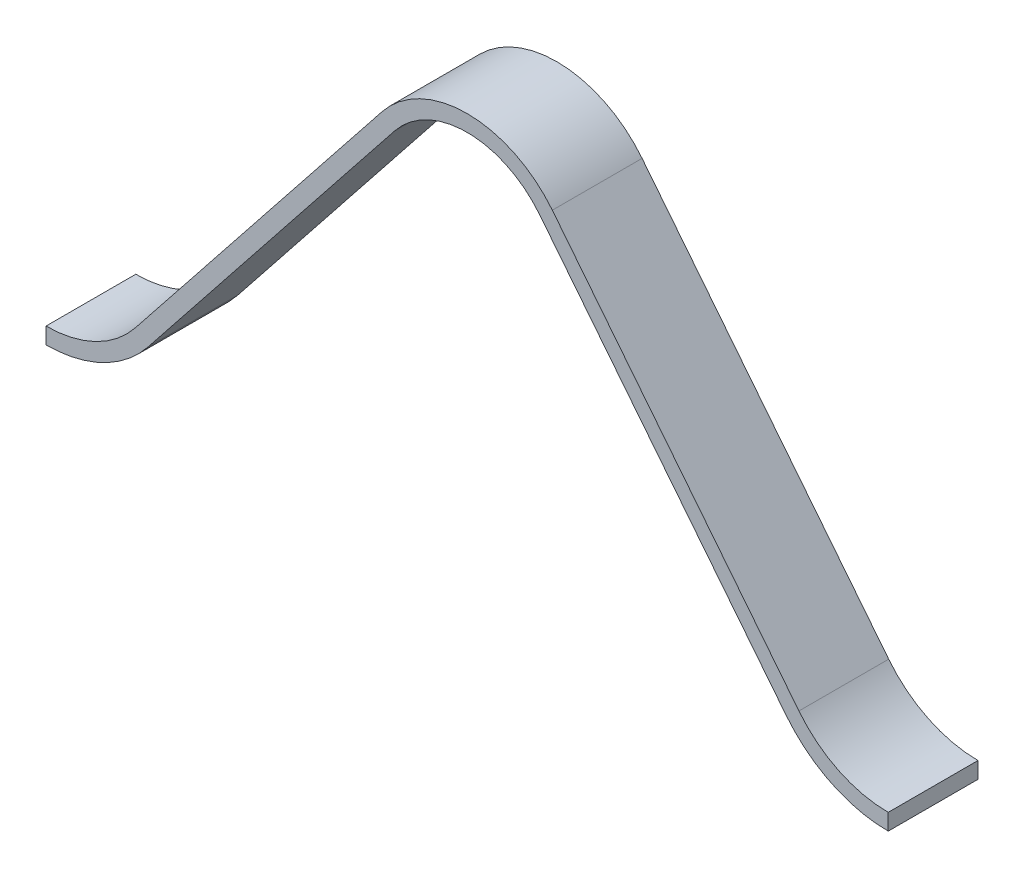
ISO-10303-21;
HEADER;
FILE_DESCRIPTION(('STEP AP214'),'2;1');
FILE_NAME('part.step','',(''),(''),'','','');
FILE_SCHEMA(('AUTOMOTIVE_DESIGN { 1 0 10303 214 1 1 1 1 }'));
ENDSEC;
DATA;
#1=APPLICATION_CONTEXT('core data for automotive mechanical design processes');
#2=APPLICATION_PROTOCOL_DEFINITION('international standard','automotive_design',2000,#1);
#3=PRODUCT_CONTEXT('',#1,'mechanical');
#4=PRODUCT('Part','Part','',(#3));
#5=PRODUCT_RELATED_PRODUCT_CATEGORY('part','',(#4));
#6=PRODUCT_DEFINITION_FORMATION('','',#4);
#7=PRODUCT_DEFINITION_CONTEXT('part definition',#1,'design');
#8=PRODUCT_DEFINITION('design','',#6,#7);
#9=PRODUCT_DEFINITION_SHAPE('','',#8);
#10=(LENGTH_UNIT() NAMED_UNIT(*) SI_UNIT(.MILLI.,.METRE.));
#11=(NAMED_UNIT(*) PLANE_ANGLE_UNIT() SI_UNIT($,.RADIAN.));
#12=(NAMED_UNIT(*) SI_UNIT($,.STERADIAN.) SOLID_ANGLE_UNIT());
#13=UNCERTAINTY_MEASURE_WITH_UNIT(LENGTH_MEASURE(1.E-05),#10,'distance_accuracy_value','');
#14=(GEOMETRIC_REPRESENTATION_CONTEXT(3) GLOBAL_UNCERTAINTY_ASSIGNED_CONTEXT((#13)) GLOBAL_UNIT_ASSIGNED_CONTEXT((#10,
#11,#12)) REPRESENTATION_CONTEXT('',''));
#15=CARTESIAN_POINT('',(0.,0.,0.));
#16=DIRECTION('',(0.,0.,1.));
#17=DIRECTION('',(1.,0.,0.));
#18=AXIS2_PLACEMENT_3D('',#15,#16,#17);
#19=CARTESIAN_POINT('',(-28.15,-11.48,0.));
#20=DIRECTION('',(0.,0.,-1.));
#21=DIRECTION('',(0.,-1.,0.));
#22=AXIS2_PLACEMENT_3D('',#19,#20,#21);
#23=PLANE('',#22);
#24=CARTESIAN_POINT('',(-28.15,-11.48,0.));
#25=DIRECTION('',(0.,0.,-1.));
#26=DIRECTION('',(-1.,0.,0.));
#27=AXIS2_PLACEMENT_3D('',#24,#25,#26);
#28=CIRCLE('',#27,7.625);
#29=CARTESIAN_POINT('',(-22.1797397026617,-16.2230598754418,0.));
#30=VERTEX_POINT('',#29);
#31=CARTESIAN_POINT('',(-28.15,-19.105,0.));
#32=VERTEX_POINT('',#31);
#33=EDGE_CURVE('E351',#30,#32,#28,.T.);
#34=ORIENTED_EDGE('',*,*,#33,.F.);
#35=DIRECTION('',(-0.622040639402208,-0.78298495702797,0.));
#36=VECTOR('',#35,1.);
#37=CARTESIAN_POINT('',(-22.1797397026617,-16.2230598754418,0.));
#38=LINE('',#37,#36);
#39=CARTESIAN_POINT('',(-5.69621556237848,4.52534565165107,0.));
#40=VERTEX_POINT('',#39);
#41=EDGE_CURVE('E26',#40,#30,#38,.T.);
#42=ORIENTED_EDGE('',*,*,#41,.F.);
#43=CARTESIAN_POINT('',(0.,0.,0.));
#44=DIRECTION('',(0.,0.,1.));
#45=DIRECTION('',(-1.,0.,0.));
#46=AXIS2_PLACEMENT_3D('',#43,#44,#45);
#47=CIRCLE('',#46,7.275);
#48=CARTESIAN_POINT('',(5.69621556237848,4.52534565165106,0.));
#49=VERTEX_POINT('',#48);
#50=EDGE_CURVE('E192',#49,#40,#47,.T.);
#51=ORIENTED_EDGE('',*,*,#50,.F.);
#52=DIRECTION('',(-0.622040639402208,0.78298495702797,0.));
#53=VECTOR('',#52,1.);
#54=CARTESIAN_POINT('',(5.69621556237848,4.52534565165107,0.));
#55=LINE('',#54,#53);
#56=CARTESIAN_POINT('',(22.1797397026617,-16.2230598754418,0.));
#57=VERTEX_POINT('',#56);
#58=EDGE_CURVE('E183',#57,#49,#55,.T.);
#59=ORIENTED_EDGE('',*,*,#58,.F.);
#60=CARTESIAN_POINT('',(28.15,-11.48,0.));
#61=DIRECTION('',(0.,0.,-1.));
#62=DIRECTION('',(1.,0.,0.));
#63=AXIS2_PLACEMENT_3D('',#60,#61,#62);
#64=CIRCLE('',#63,7.625);
#65=CARTESIAN_POINT('',(28.15,-19.105,0.));
#66=VERTEX_POINT('',#65);
#67=EDGE_CURVE('E144',#66,#57,#64,.T.);
#68=ORIENTED_EDGE('',*,*,#67,.F.);
#69=DIRECTION('',(0.,1.,0.));
#70=VECTOR('',#69,1.);
#71=CARTESIAN_POINT('',(28.15,-19.105,0.));
#72=LINE('',#71,#70);
#73=CARTESIAN_POINT('',(28.15,-20.195,0.));
#74=VERTEX_POINT('',#73);
#75=EDGE_CURVE('E156',#74,#66,#72,.T.);
#76=ORIENTED_EDGE('',*,*,#75,.F.);
#77=CARTESIAN_POINT('',(28.15,-11.48,0.));
#78=DIRECTION('',(0.,0.,1.));
#79=DIRECTION('',(1.,0.,0.));
#80=AXIS2_PLACEMENT_3D('',#77,#78,#79);
#81=CIRCLE('',#80,8.715);
#82=CARTESIAN_POINT('',(21.3262860995012,-16.9010841723903,0.));
#83=VERTEX_POINT('',#82);
#84=EDGE_CURVE('E159',#83,#74,#81,.T.);
#85=ORIENTED_EDGE('',*,*,#84,.F.);
#86=DIRECTION('',(0.622040639402208,-0.78298495702797,0.));
#87=VECTOR('',#86,1.);
#88=CARTESIAN_POINT('',(4.84276195921799,3.84732135470265,0.));
#89=LINE('',#88,#87);
#90=CARTESIAN_POINT('',(4.84276195921799,3.84732135470265,0.));
#91=VERTEX_POINT('',#90);
#92=EDGE_CURVE('E233',#91,#83,#89,.T.);
#93=ORIENTED_EDGE('',*,*,#92,.F.);
#94=CARTESIAN_POINT('',(0.,0.,0.));
#95=DIRECTION('',(0.,0.,-1.));
#96=DIRECTION('',(-1.,0.,0.));
#97=AXIS2_PLACEMENT_3D('',#94,#95,#96);
#98=CIRCLE('',#97,6.185);
#99=CARTESIAN_POINT('',(-4.84276195921799,3.84732135470266,0.));
#100=VERTEX_POINT('',#99);
#101=EDGE_CURVE('E217',#100,#91,#98,.T.);
#102=ORIENTED_EDGE('',*,*,#101,.F.);
#103=DIRECTION('',(0.622040639402208,0.78298495702797,0.));
#104=VECTOR('',#103,1.);
#105=CARTESIAN_POINT('',(-21.3262860995012,-16.9010841723903,0.));
#106=LINE('',#105,#104);
#107=CARTESIAN_POINT('',(-21.3262860995012,-16.9010841723903,0.));
#108=VERTEX_POINT('',#107);
#109=EDGE_CURVE('E216',#108,#100,#106,.T.);
#110=ORIENTED_EDGE('',*,*,#109,.F.);
#111=CARTESIAN_POINT('',(-28.15,-11.48,0.));
#112=DIRECTION('',(0.,0.,1.));
#113=DIRECTION('',(-1.,0.,0.));
#114=AXIS2_PLACEMENT_3D('',#111,#112,#113);
#115=CIRCLE('',#114,8.715);
#116=CARTESIAN_POINT('',(-28.15,-20.195,0.));
#117=VERTEX_POINT('',#116);
#118=EDGE_CURVE('E301',#117,#108,#115,.T.);
#119=ORIENTED_EDGE('',*,*,#118,.F.);
#120=DIRECTION('',(0.,-1.,0.));
#121=VECTOR('',#120,1.);
#122=CARTESIAN_POINT('',(-28.15,-19.105,0.));
#123=LINE('',#122,#121);
#124=EDGE_CURVE('E324',#32,#117,#123,.T.);
#125=ORIENTED_EDGE('',*,*,#124,.F.);
#126=EDGE_LOOP('',(#34,#42,#51,#59,#68,#76,#85,#93,#102,#110,#119,#125));
#127=FACE_BOUND('',#126,.T.);
#128=ADVANCED_FACE('F17',(#127),#23,.T.);
#129=CARTESIAN_POINT('',(-28.15,-11.48,6.));
#130=DIRECTION('',(0.,0.,-1.));
#131=DIRECTION('',(0.,-1.,0.));
#132=AXIS2_PLACEMENT_3D('',#129,#130,#131);
#133=PLANE('',#132);
#134=CARTESIAN_POINT('',(-28.15,-11.48,6.));
#135=DIRECTION('',(0.,0.,-1.));
#136=DIRECTION('',(-1.,0.,0.));
#137=AXIS2_PLACEMENT_3D('',#134,#135,#136);
#138=CIRCLE('',#137,7.625);
#139=CARTESIAN_POINT('',(-22.1797397026617,-16.2230598754418,6.));
#140=VERTEX_POINT('',#139);
#141=CARTESIAN_POINT('',(-28.15,-19.105,6.));
#142=VERTEX_POINT('',#141);
#143=EDGE_CURVE('E336',#140,#142,#138,.T.);
#144=ORIENTED_EDGE('',*,*,#143,.T.);
#145=DIRECTION('',(0.,-1.,0.));
#146=VECTOR('',#145,1.);
#147=CARTESIAN_POINT('',(-28.15,-19.105,6.));
#148=LINE('',#147,#146);
#149=CARTESIAN_POINT('',(-28.15,-20.195,6.));
#150=VERTEX_POINT('',#149);
#151=EDGE_CURVE('E308',#142,#150,#148,.T.);
#152=ORIENTED_EDGE('',*,*,#151,.T.);
#153=CARTESIAN_POINT('',(-28.15,-11.48,6.));
#154=DIRECTION('',(0.,0.,1.));
#155=DIRECTION('',(-1.,0.,0.));
#156=AXIS2_PLACEMENT_3D('',#153,#154,#155);
#157=CIRCLE('',#156,8.715);
#158=CARTESIAN_POINT('',(-21.3262860995012,-16.9010841723903,6.));
#159=VERTEX_POINT('',#158);
#160=EDGE_CURVE('E212',#150,#159,#157,.T.);
#161=ORIENTED_EDGE('',*,*,#160,.T.);
#162=DIRECTION('',(0.622040639402208,0.78298495702797,0.));
#163=VECTOR('',#162,1.);
#164=CARTESIAN_POINT('',(-21.3262860995012,-16.9010841723903,6.));
#165=LINE('',#164,#163);
#166=CARTESIAN_POINT('',(-4.84276195921799,3.84732135470266,6.));
#167=VERTEX_POINT('',#166);
#168=EDGE_CURVE('E222',#159,#167,#165,.T.);
#169=ORIENTED_EDGE('',*,*,#168,.T.);
#170=CARTESIAN_POINT('',(0.,0.,6.));
#171=DIRECTION('',(0.,0.,-1.));
#172=DIRECTION('',(-1.,0.,0.));
#173=AXIS2_PLACEMENT_3D('',#170,#171,#172);
#174=CIRCLE('',#173,6.185);
#175=CARTESIAN_POINT('',(4.84276195921799,3.84732135470265,6.));
#176=VERTEX_POINT('',#175);
#177=EDGE_CURVE('E238',#167,#176,#174,.T.);
#178=ORIENTED_EDGE('',*,*,#177,.T.);
#179=DIRECTION('',(0.622040639402208,-0.78298495702797,0.));
#180=VECTOR('',#179,1.);
#181=CARTESIAN_POINT('',(4.84276195921799,3.84732135470265,6.));
#182=LINE('',#181,#180);
#183=CARTESIAN_POINT('',(21.3262860995012,-16.9010841723903,6.));
#184=VERTEX_POINT('',#183);
#185=EDGE_CURVE('E151',#176,#184,#182,.T.);
#186=ORIENTED_EDGE('',*,*,#185,.T.);
#187=CARTESIAN_POINT('',(28.15,-11.48,6.));
#188=DIRECTION('',(0.,0.,1.));
#189=DIRECTION('',(1.,0.,0.));
#190=AXIS2_PLACEMENT_3D('',#187,#188,#189);
#191=CIRCLE('',#190,8.715);
#192=CARTESIAN_POINT('',(28.15,-20.195,6.));
#193=VERTEX_POINT('',#192);
#194=EDGE_CURVE('E147',#184,#193,#191,.T.);
#195=ORIENTED_EDGE('',*,*,#194,.T.);
#196=DIRECTION('',(0.,1.,0.));
#197=VECTOR('',#196,1.);
#198=CARTESIAN_POINT('',(28.15,-19.105,6.));
#199=LINE('',#198,#197);
#200=CARTESIAN_POINT('',(28.15,-19.105,6.));
#201=VERTEX_POINT('',#200);
#202=EDGE_CURVE('E132',#193,#201,#199,.T.);
#203=ORIENTED_EDGE('',*,*,#202,.T.);
#204=CARTESIAN_POINT('',(28.15,-11.48,6.));
#205=DIRECTION('',(0.,0.,-1.));
#206=DIRECTION('',(1.,0.,0.));
#207=AXIS2_PLACEMENT_3D('',#204,#205,#206);
#208=CIRCLE('',#207,7.625);
#209=CARTESIAN_POINT('',(22.1797397026617,-16.2230598754418,6.));
#210=VERTEX_POINT('',#209);
#211=EDGE_CURVE('E180',#201,#210,#208,.T.);
#212=ORIENTED_EDGE('',*,*,#211,.T.);
#213=DIRECTION('',(-0.622040639402208,0.78298495702797,0.));
#214=VECTOR('',#213,1.);
#215=CARTESIAN_POINT('',(5.69621556237848,4.52534565165107,6.));
#216=LINE('',#215,#214);
#217=CARTESIAN_POINT('',(5.69621556237848,4.52534565165106,6.));
#218=VERTEX_POINT('',#217);
#219=EDGE_CURVE('E188',#210,#218,#216,.T.);
#220=ORIENTED_EDGE('',*,*,#219,.T.);
#221=CARTESIAN_POINT('',(0.,0.,6.));
#222=DIRECTION('',(0.,0.,1.));
#223=DIRECTION('',(-1.,0.,0.));
#224=AXIS2_PLACEMENT_3D('',#221,#222,#223);
#225=CIRCLE('',#224,7.275);
#226=CARTESIAN_POINT('',(-5.69621556237848,4.52534565165107,6.));
#227=VERTEX_POINT('',#226);
#228=EDGE_CURVE('E195',#218,#227,#225,.T.);
#229=ORIENTED_EDGE('',*,*,#228,.T.);
#230=DIRECTION('',(-0.622040639402208,-0.78298495702797,0.));
#231=VECTOR('',#230,1.);
#232=CARTESIAN_POINT('',(-22.1797397026617,-16.2230598754418,6.));
#233=LINE('',#232,#231);
#234=EDGE_CURVE('E11',#227,#140,#233,.T.);
#235=ORIENTED_EDGE('',*,*,#234,.T.);
#236=EDGE_LOOP('',(#144,#152,#161,#169,#178,#186,#195,#203,#212,#220,#229,#235));
#237=FACE_BOUND('',#236,.T.);
#238=ADVANCED_FACE('F149',(#237),#133,.F.);
#239=CARTESIAN_POINT('',(-22.1797397026617,-16.2230598754418,6.));
#240=DIRECTION('',(0.78298495702797,-0.622040639402208,0.));
#241=DIRECTION('',(0.,0.,-1.));
#242=AXIS2_PLACEMENT_3D('',#239,#240,#241);
#243=PLANE('',#242);
#244=ORIENTED_EDGE('',*,*,#41,.T.);
#245=DIRECTION('',(0.,0.,-1.));
#246=VECTOR('',#245,1.);
#247=CARTESIAN_POINT('',(-22.1797397026617,-16.2230598754418,6.));
#248=LINE('',#247,#246);
#249=EDGE_CURVE('E330',#140,#30,#248,.T.);
#250=ORIENTED_EDGE('',*,*,#249,.F.);
#251=ORIENTED_EDGE('',*,*,#234,.F.);
#252=DIRECTION('',(0.,0.,-1.));
#253=VECTOR('',#252,1.);
#254=CARTESIAN_POINT('',(-5.69621556237848,4.52534565165107,6.));
#255=LINE('',#254,#253);
#256=EDGE_CURVE('E193',#227,#40,#255,.T.);
#257=ORIENTED_EDGE('',*,*,#256,.T.);
#258=EDGE_LOOP('',(#244,#250,#251,#257));
#259=FACE_BOUND('',#258,.T.);
#260=ADVANCED_FACE('F454',(#259),#243,.F.);
#261=CARTESIAN_POINT('',(0.,0.,6.));
#262=DIRECTION('',(0.,0.,-1.));
#263=DIRECTION('',(-1.,0.,0.));
#264=AXIS2_PLACEMENT_3D('',#261,#262,#263);
#265=CYLINDRICAL_SURFACE('',#264,7.275);
#266=ORIENTED_EDGE('',*,*,#50,.T.);
#267=ORIENTED_EDGE('',*,*,#256,.F.);
#268=ORIENTED_EDGE('',*,*,#228,.F.);
#269=DIRECTION('',(0.,0.,-1.));
#270=VECTOR('',#269,1.);
#271=CARTESIAN_POINT('',(5.69621556237848,4.52534565165106,6.));
#272=LINE('',#271,#270);
#273=EDGE_CURVE('E187',#218,#49,#272,.T.);
#274=ORIENTED_EDGE('',*,*,#273,.T.);
#275=EDGE_LOOP('',(#266,#267,#268,#274));
#276=FACE_BOUND('',#275,.T.);
#277=ADVANCED_FACE('F449',(#276),#265,.T.);
#278=CARTESIAN_POINT('',(5.69621556237848,4.52534565165107,6.));
#279=DIRECTION('',(-0.78298495702797,-0.622040639402208,0.));
#280=DIRECTION('',(-0.622040639402208,0.78298495702797,0.));
#281=AXIS2_PLACEMENT_3D('',#278,#279,#280);
#282=PLANE('',#281);
#283=ORIENTED_EDGE('',*,*,#58,.T.);
#284=ORIENTED_EDGE('',*,*,#273,.F.);
#285=ORIENTED_EDGE('',*,*,#219,.F.);
#286=DIRECTION('',(0.,0.,-1.));
#287=VECTOR('',#286,1.);
#288=CARTESIAN_POINT('',(22.1797397026617,-16.2230598754418,6.));
#289=LINE('',#288,#287);
#290=EDGE_CURVE('E176',#210,#57,#289,.T.);
#291=ORIENTED_EDGE('',*,*,#290,.T.);
#292=EDGE_LOOP('',(#283,#284,#285,#291));
#293=FACE_BOUND('',#292,.T.);
#294=ADVANCED_FACE('F453',(#293),#282,.F.);
#295=CARTESIAN_POINT('',(28.15,-11.48,6.));
#296=DIRECTION('',(0.,0.,-1.));
#297=DIRECTION('',(-1.,0.,0.));
#298=AXIS2_PLACEMENT_3D('',#295,#296,#297);
#299=CYLINDRICAL_SURFACE('',#298,7.625);
#300=ORIENTED_EDGE('',*,*,#67,.T.);
#301=ORIENTED_EDGE('',*,*,#290,.F.);
#302=ORIENTED_EDGE('',*,*,#211,.F.);
#303=DIRECTION('',(0.,0.,-1.));
#304=VECTOR('',#303,1.);
#305=CARTESIAN_POINT('',(28.15,-19.105,6.));
#306=LINE('',#305,#304);
#307=EDGE_CURVE('E140',#201,#66,#306,.T.);
#308=ORIENTED_EDGE('',*,*,#307,.T.);
#309=EDGE_LOOP('',(#300,#301,#302,#308));
#310=FACE_BOUND('',#309,.T.);
#311=ADVANCED_FACE('F524',(#310),#299,.F.);
#312=CARTESIAN_POINT('',(28.15,-19.105,6.));
#313=DIRECTION('',(-1.,0.,0.));
#314=DIRECTION('',(0.,0.,1.));
#315=AXIS2_PLACEMENT_3D('',#312,#313,#314);
#316=PLANE('',#315);
#317=ORIENTED_EDGE('',*,*,#75,.T.);
#318=ORIENTED_EDGE('',*,*,#307,.F.);
#319=ORIENTED_EDGE('',*,*,#202,.F.);
#320=DIRECTION('',(0.,0.,-1.));
#321=VECTOR('',#320,1.);
#322=CARTESIAN_POINT('',(28.15,-20.195,6.));
#323=LINE('',#322,#321);
#324=EDGE_CURVE('E137',#193,#74,#323,.T.);
#325=ORIENTED_EDGE('',*,*,#324,.T.);
#326=EDGE_LOOP('',(#317,#318,#319,#325));
#327=FACE_BOUND('',#326,.T.);
#328=ADVANCED_FACE('F135',(#327),#316,.F.);
#329=CARTESIAN_POINT('',(28.15,-11.48,6.));
#330=DIRECTION('',(0.,0.,-1.));
#331=DIRECTION('',(-1.,0.,0.));
#332=AXIS2_PLACEMENT_3D('',#329,#330,#331);
#333=CYLINDRICAL_SURFACE('',#332,8.715);
#334=ORIENTED_EDGE('',*,*,#84,.T.);
#335=ORIENTED_EDGE('',*,*,#324,.F.);
#336=ORIENTED_EDGE('',*,*,#194,.F.);
#337=DIRECTION('',(0.,0.,-1.));
#338=VECTOR('',#337,1.);
#339=CARTESIAN_POINT('',(21.3262860995012,-16.9010841723903,6.));
#340=LINE('',#339,#338);
#341=EDGE_CURVE('E237',#184,#83,#340,.T.);
#342=ORIENTED_EDGE('',*,*,#341,.T.);
#343=EDGE_LOOP('',(#334,#335,#336,#342));
#344=FACE_BOUND('',#343,.T.);
#345=ADVANCED_FACE('F158',(#344),#333,.T.);
#346=CARTESIAN_POINT('',(4.84276195921799,3.84732135470265,6.));
#347=DIRECTION('',(0.78298495702797,0.622040639402209,0.));
#348=DIRECTION('',(0.,0.,-1.));
#349=AXIS2_PLACEMENT_3D('',#346,#347,#348);
#350=PLANE('',#349);
#351=ORIENTED_EDGE('',*,*,#92,.T.);
#352=ORIENTED_EDGE('',*,*,#341,.F.);
#353=ORIENTED_EDGE('',*,*,#185,.F.);
#354=DIRECTION('',(0.,0.,-1.));
#355=VECTOR('',#354,1.);
#356=CARTESIAN_POINT('',(4.84276195921799,3.84732135470265,6.));
#357=LINE('',#356,#355);
#358=EDGE_CURVE('E221',#176,#91,#357,.T.);
#359=ORIENTED_EDGE('',*,*,#358,.T.);
#360=EDGE_LOOP('',(#351,#352,#353,#359));
#361=FACE_BOUND('',#360,.T.);
#362=ADVANCED_FACE('F500',(#361),#350,.F.);
#363=CARTESIAN_POINT('',(0.,0.,6.));
#364=DIRECTION('',(0.,0.,-1.));
#365=DIRECTION('',(-1.,0.,0.));
#366=AXIS2_PLACEMENT_3D('',#363,#364,#365);
#367=CYLINDRICAL_SURFACE('',#366,6.185);
#368=ORIENTED_EDGE('',*,*,#101,.T.);
#369=ORIENTED_EDGE('',*,*,#358,.F.);
#370=ORIENTED_EDGE('',*,*,#177,.F.);
#371=DIRECTION('',(0.,0.,-1.));
#372=VECTOR('',#371,1.);
#373=CARTESIAN_POINT('',(-4.84276195921799,3.84732135470266,6.));
#374=LINE('',#373,#372);
#375=EDGE_CURVE('E226',#167,#100,#374,.T.);
#376=ORIENTED_EDGE('',*,*,#375,.T.);
#377=EDGE_LOOP('',(#368,#369,#370,#376));
#378=FACE_BOUND('',#377,.T.);
#379=ADVANCED_FACE('F491',(#378),#367,.F.);
#380=CARTESIAN_POINT('',(-21.3262860995012,-16.9010841723903,6.));
#381=DIRECTION('',(-0.78298495702797,0.622040639402208,0.));
#382=DIRECTION('',(0.,0.,1.));
#383=AXIS2_PLACEMENT_3D('',#380,#381,#382);
#384=PLANE('',#383);
#385=ORIENTED_EDGE('',*,*,#109,.T.);
#386=ORIENTED_EDGE('',*,*,#375,.F.);
#387=ORIENTED_EDGE('',*,*,#168,.F.);
#388=DIRECTION('',(0.,0.,-1.));
#389=VECTOR('',#388,1.);
#390=CARTESIAN_POINT('',(-21.3262860995012,-16.9010841723903,6.));
#391=LINE('',#390,#389);
#392=EDGE_CURVE('E207',#159,#108,#391,.T.);
#393=ORIENTED_EDGE('',*,*,#392,.T.);
#394=EDGE_LOOP('',(#385,#386,#387,#393));
#395=FACE_BOUND('',#394,.T.);
#396=ADVANCED_FACE('F474',(#395),#384,.F.);
#397=CARTESIAN_POINT('',(-28.15,-11.48,6.));
#398=DIRECTION('',(0.,0.,-1.));
#399=DIRECTION('',(-1.,0.,0.));
#400=AXIS2_PLACEMENT_3D('',#397,#398,#399);
#401=CYLINDRICAL_SURFACE('',#400,8.715);
#402=ORIENTED_EDGE('',*,*,#118,.T.);
#403=ORIENTED_EDGE('',*,*,#392,.F.);
#404=ORIENTED_EDGE('',*,*,#160,.F.);
#405=DIRECTION('',(0.,0.,-1.));
#406=VECTOR('',#405,1.);
#407=CARTESIAN_POINT('',(-28.15,-20.195,6.));
#408=LINE('',#407,#406);
#409=EDGE_CURVE('E316',#150,#117,#408,.T.);
#410=ORIENTED_EDGE('',*,*,#409,.T.);
#411=EDGE_LOOP('',(#402,#403,#404,#410));
#412=FACE_BOUND('',#411,.T.);
#413=ADVANCED_FACE('F470',(#412),#401,.T.);
#414=CARTESIAN_POINT('',(-28.15,-19.105,6.));
#415=DIRECTION('',(1.,0.,0.));
#416=DIRECTION('',(0.,1.,0.));
#417=AXIS2_PLACEMENT_3D('',#414,#415,#416);
#418=PLANE('',#417);
#419=ORIENTED_EDGE('',*,*,#124,.T.);
#420=ORIENTED_EDGE('',*,*,#409,.F.);
#421=ORIENTED_EDGE('',*,*,#151,.F.);
#422=DIRECTION('',(0.,0.,-1.));
#423=VECTOR('',#422,1.);
#424=CARTESIAN_POINT('',(-28.15,-19.105,6.));
#425=LINE('',#424,#423);
#426=EDGE_CURVE('E343',#142,#32,#425,.T.);
#427=ORIENTED_EDGE('',*,*,#426,.T.);
#428=EDGE_LOOP('',(#419,#420,#421,#427));
#429=FACE_BOUND('',#428,.T.);
#430=ADVANCED_FACE('F464',(#429),#418,.F.);
#431=CARTESIAN_POINT('',(-28.15,-11.48,6.));
#432=DIRECTION('',(0.,0.,-1.));
#433=DIRECTION('',(-1.,0.,0.));
#434=AXIS2_PLACEMENT_3D('',#431,#432,#433);
#435=CYLINDRICAL_SURFACE('',#434,7.625);
#436=ORIENTED_EDGE('',*,*,#33,.T.);
#437=ORIENTED_EDGE('',*,*,#426,.F.);
#438=ORIENTED_EDGE('',*,*,#143,.F.);
#439=ORIENTED_EDGE('',*,*,#249,.T.);
#440=EDGE_LOOP('',(#436,#437,#438,#439));
#441=FACE_BOUND('',#440,.T.);
#442=ADVANCED_FACE('F460',(#441),#435,.F.);
#443=CLOSED_SHELL('',(#128,#238,#260,#277,#294,#311,#328,#345,#362,#379,#396,#413,#430,#442));
#444=MANIFOLD_SOLID_BREP('B1',#443);
#445=ADVANCED_BREP_SHAPE_REPRESENTATION('',(#18,#444),#14);
#446=SHAPE_DEFINITION_REPRESENTATION(#9,#445);
ENDSEC;
END-ISO-10303-21;
